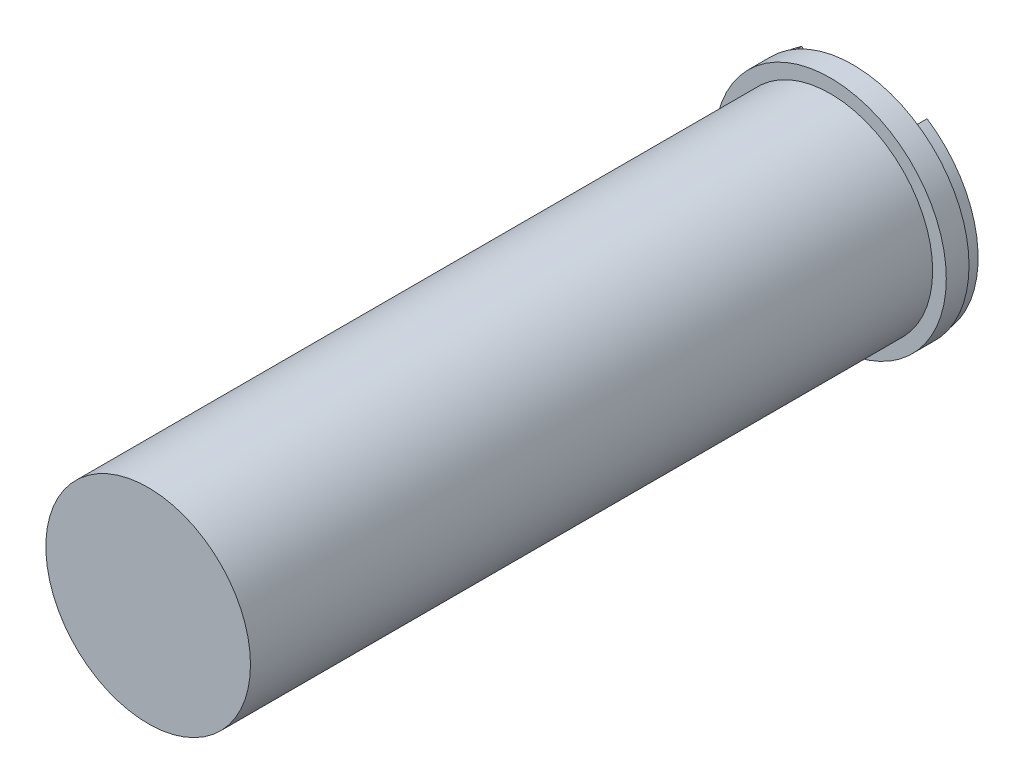
ISO-10303-21;
HEADER;
FILE_DESCRIPTION(('STEP AP214'),'2;1');
FILE_NAME('part.step','',(''),(''),'','','');
FILE_SCHEMA(('AUTOMOTIVE_DESIGN { 1 0 10303 214 1 1 1 1 }'));
ENDSEC;
DATA;
#1=APPLICATION_CONTEXT('core data for automotive mechanical design processes');
#2=APPLICATION_PROTOCOL_DEFINITION('international standard','automotive_design',2000,#1);
#3=PRODUCT_CONTEXT('',#1,'mechanical');
#4=PRODUCT('Part','Part','',(#3));
#5=PRODUCT_RELATED_PRODUCT_CATEGORY('part','',(#4));
#6=PRODUCT_DEFINITION_FORMATION('','',#4);
#7=PRODUCT_DEFINITION_CONTEXT('part definition',#1,'design');
#8=PRODUCT_DEFINITION('design','',#6,#7);
#9=PRODUCT_DEFINITION_SHAPE('','',#8);
#10=(LENGTH_UNIT() NAMED_UNIT(*) SI_UNIT(.MILLI.,.METRE.));
#11=(NAMED_UNIT(*) PLANE_ANGLE_UNIT() SI_UNIT($,.RADIAN.));
#12=(NAMED_UNIT(*) SI_UNIT($,.STERADIAN.) SOLID_ANGLE_UNIT());
#13=UNCERTAINTY_MEASURE_WITH_UNIT(LENGTH_MEASURE(1.E-05),#10,'distance_accuracy_value','');
#14=(GEOMETRIC_REPRESENTATION_CONTEXT(3) GLOBAL_UNCERTAINTY_ASSIGNED_CONTEXT((#13)) GLOBAL_UNIT_ASSIGNED_CONTEXT((#10,
#11,#12)) REPRESENTATION_CONTEXT('',''));
#15=CARTESIAN_POINT('',(0.,0.,0.));
#16=DIRECTION('',(0.,0.,1.));
#17=DIRECTION('',(1.,0.,0.));
#18=AXIS2_PLACEMENT_3D('',#15,#16,#17);
#19=CARTESIAN_POINT('',(0.,0.,-0.5));
#20=DIRECTION('',(0.,0.,-1.));
#21=DIRECTION('',(-1.,0.,0.));
#22=AXIS2_PLACEMENT_3D('',#19,#20,#21);
#23=PLANE('',#22);
#24=CARTESIAN_POINT('',(0.,0.,-0.5));
#25=DIRECTION('',(0.,0.,-1.));
#26=DIRECTION('',(-1.,0.,0.));
#27=AXIS2_PLACEMENT_3D('',#24,#25,#26);
#28=CIRCLE('',#27,4.);
#29=CARTESIAN_POINT('',(2.82842712474621,2.82842712474617,-0.5));
#30=VERTEX_POINT('',#29);
#31=CARTESIAN_POINT('',(3.96862696659689,0.5,-0.5));
#32=VERTEX_POINT('',#31);
#33=EDGE_CURVE('E144',#30,#32,#28,.T.);
#34=ORIENTED_EDGE('',*,*,#33,.F.);
#35=DIRECTION('',(0.707106781186551,0.707106781186543,0.));
#36=VECTOR('',#35,1.);
#37=CARTESIAN_POINT('',(2.82842712474621,2.82842712474617,-0.5));
#38=LINE('',#37,#36);
#39=CARTESIAN_POINT('',(0.500000000000014,0.5,-0.5));
#40=VERTEX_POINT('',#39);
#41=EDGE_CURVE('E142',#40,#30,#38,.T.);
#42=ORIENTED_EDGE('',*,*,#41,.F.);
#43=DIRECTION('',(-1.,0.,0.));
#44=VECTOR('',#43,1.);
#45=CARTESIAN_POINT('',(3.96862696659689,0.5,-0.5));
#46=LINE('',#45,#44);
#47=EDGE_CURVE('E148',#32,#40,#46,.T.);
#48=ORIENTED_EDGE('',*,*,#47,.F.);
#49=EDGE_LOOP('',(#34,#42,#48));
#50=FACE_BOUND('',#49,.T.);
#51=CARTESIAN_POINT('',(0.,0.,-0.5));
#52=DIRECTION('',(0.,0.,-1.));
#53=DIRECTION('',(-1.,0.,0.));
#54=AXIS2_PLACEMENT_3D('',#51,#52,#53);
#55=CIRCLE('',#54,5.);
#56=CARTESIAN_POINT('',(2.75699483395121,4.1712083963243,-0.5));
#57=VERTEX_POINT('',#56);
#58=CARTESIAN_POINT('',(-2.75699483395121,4.1712083963243,-0.5));
#59=VERTEX_POINT('',#58);
#60=EDGE_CURVE('E190',#57,#59,#55,.T.);
#61=ORIENTED_EDGE('',*,*,#60,.T.);
#62=DIRECTION('',(0.707106781186551,-0.707106781186544,0.));
#63=VECTOR('',#62,1.);
#64=CARTESIAN_POINT('',(-2.75699483395121,4.1712083963243,-0.5));
#65=LINE('',#64,#63);
#66=CARTESIAN_POINT('',(0.,1.41421356237312,-0.5));
#67=VERTEX_POINT('',#66);
#68=EDGE_CURVE('E193',#59,#67,#65,.T.);
#69=ORIENTED_EDGE('',*,*,#68,.T.);
#70=DIRECTION('',(0.707106781186552,0.707106781186543,0.));
#71=VECTOR('',#70,1.);
#72=CARTESIAN_POINT('',(2.75699483395121,4.1712083963243,-0.5));
#73=LINE('',#72,#71);
#74=EDGE_CURVE('E196',#67,#57,#73,.T.);
#75=ORIENTED_EDGE('',*,*,#74,.T.);
#76=EDGE_LOOP('',(#61,#69,#75));
#77=FACE_BOUND('',#76,.T.);
#78=DIRECTION('',(0.707106781186546,-0.707106781186549,0.));
#79=VECTOR('',#78,1.);
#80=CARTESIAN_POINT('',(-2.82842712474619,2.82842712474619,-0.5));
#81=LINE('',#80,#79);
#82=CARTESIAN_POINT('',(-2.82842712474619,2.82842712474619,-0.5));
#83=VERTEX_POINT('',#82);
#84=CARTESIAN_POINT('',(-0.499999999999973,0.499999999999967,-0.5));
#85=VERTEX_POINT('',#84);
#86=EDGE_CURVE('E168',#83,#85,#81,.T.);
#87=ORIENTED_EDGE('',*,*,#86,.F.);
#88=CARTESIAN_POINT('',(0.,0.,-0.5));
#89=DIRECTION('',(0.,0.,-1.));
#90=DIRECTION('',(-1.,0.,0.));
#91=AXIS2_PLACEMENT_3D('',#88,#89,#90);
#92=CIRCLE('',#91,4.);
#93=CARTESIAN_POINT('',(-3.96862696659689,0.5,-0.5));
#94=VERTEX_POINT('',#93);
#95=EDGE_CURVE('E166',#94,#83,#92,.T.);
#96=ORIENTED_EDGE('',*,*,#95,.F.);
#97=DIRECTION('',(-1.,0.,0.));
#98=VECTOR('',#97,1.);
#99=CARTESIAN_POINT('',(-0.499999999999973,0.499999999999967,-0.5));
#100=LINE('',#99,#98);
#101=EDGE_CURVE('E172',#85,#94,#100,.T.);
#102=ORIENTED_EDGE('',*,*,#101,.F.);
#103=EDGE_LOOP('',(#87,#96,#102));
#104=FACE_BOUND('',#103,.T.);
#105=DIRECTION('',(1.,0.,0.));
#106=VECTOR('',#105,1.);
#107=CARTESIAN_POINT('',(3.96862696659689,-0.5,-0.5));
#108=LINE('',#107,#106);
#109=CARTESIAN_POINT('',(-3.96862696659689,-0.5,-0.5));
#110=VERTEX_POINT('',#109);
#111=CARTESIAN_POINT('',(3.96862696659689,-0.5,-0.5));
#112=VERTEX_POINT('',#111);
#113=EDGE_CURVE('E125',#110,#112,#108,.T.);
#114=ORIENTED_EDGE('',*,*,#113,.F.);
#115=CARTESIAN_POINT('',(0.,0.,-0.5));
#116=DIRECTION('',(0.,0.,-1.));
#117=DIRECTION('',(-1.,0.,0.));
#118=AXIS2_PLACEMENT_3D('',#115,#116,#117);
#119=CIRCLE('',#118,4.);
#120=EDGE_CURVE('E131',#112,#110,#119,.T.);
#121=ORIENTED_EDGE('',*,*,#120,.F.);
#122=EDGE_LOOP('',(#114,#121));
#123=FACE_BOUND('',#122,.T.);
#124=ADVANCED_FACE('F43',(#50,#77,#104,#123),#23,.T.);
#125=CARTESIAN_POINT('',(0.,0.,0.));
#126=DIRECTION('',(0.,0.,-1.));
#127=DIRECTION('',(-1.,0.,0.));
#128=AXIS2_PLACEMENT_3D('',#125,#126,#127);
#129=PLANE('',#128);
#130=DIRECTION('',(0.707106781186551,0.707106781186543,0.));
#131=VECTOR('',#130,1.);
#132=CARTESIAN_POINT('',(2.82842712474621,2.82842712474617,0.));
#133=LINE('',#132,#131);
#134=CARTESIAN_POINT('',(0.500000000000014,0.5,0.));
#135=VERTEX_POINT('',#134);
#136=CARTESIAN_POINT('',(2.82842712474621,2.82842712474617,0.));
#137=VERTEX_POINT('',#136);
#138=EDGE_CURVE('E141',#135,#137,#133,.T.);
#139=ORIENTED_EDGE('',*,*,#138,.T.);
#140=CARTESIAN_POINT('',(0.,0.,0.));
#141=DIRECTION('',(0.,0.,-1.));
#142=DIRECTION('',(-1.,0.,0.));
#143=AXIS2_PLACEMENT_3D('',#140,#141,#142);
#144=CIRCLE('',#143,4.);
#145=CARTESIAN_POINT('',(3.96862696659689,0.5,0.));
#146=VERTEX_POINT('',#145);
#147=EDGE_CURVE('E153',#137,#146,#144,.T.);
#148=ORIENTED_EDGE('',*,*,#147,.T.);
#149=DIRECTION('',(-1.,0.,0.));
#150=VECTOR('',#149,1.);
#151=CARTESIAN_POINT('',(3.96862696659689,0.5,0.));
#152=LINE('',#151,#150);
#153=EDGE_CURVE('E145',#146,#135,#152,.T.);
#154=ORIENTED_EDGE('',*,*,#153,.T.);
#155=EDGE_LOOP('',(#139,#148,#154));
#156=FACE_BOUND('',#155,.T.);
#157=CARTESIAN_POINT('',(0.,0.,0.));
#158=DIRECTION('',(0.,0.,-1.));
#159=DIRECTION('',(-1.,0.,0.));
#160=AXIS2_PLACEMENT_3D('',#157,#158,#159);
#161=CIRCLE('',#160,5.);
#162=CARTESIAN_POINT('',(2.75699483395121,4.1712083963243,0.));
#163=VERTEX_POINT('',#162);
#164=CARTESIAN_POINT('',(-2.75699483395121,4.1712083963243,0.));
#165=VERTEX_POINT('',#164);
#166=EDGE_CURVE('E189',#163,#165,#161,.T.);
#167=ORIENTED_EDGE('',*,*,#166,.F.);
#168=DIRECTION('',(0.707106781186552,0.707106781186543,0.));
#169=VECTOR('',#168,1.);
#170=CARTESIAN_POINT('',(2.75699483395121,4.1712083963243,0.));
#171=LINE('',#170,#169);
#172=CARTESIAN_POINT('',(0.,1.41421356237312,0.));
#173=VERTEX_POINT('',#172);
#174=EDGE_CURVE('E194',#173,#163,#171,.T.);
#175=ORIENTED_EDGE('',*,*,#174,.F.);
#176=DIRECTION('',(0.707106781186551,-0.707106781186544,0.));
#177=VECTOR('',#176,1.);
#178=CARTESIAN_POINT('',(-2.75699483395121,4.1712083963243,0.));
#179=LINE('',#178,#177);
#180=EDGE_CURVE('E201',#165,#173,#179,.T.);
#181=ORIENTED_EDGE('',*,*,#180,.F.);
#182=EDGE_LOOP('',(#167,#175,#181));
#183=FACE_BOUND('',#182,.T.);
#184=CARTESIAN_POINT('',(0.,0.,0.));
#185=DIRECTION('',(0.,0.,-1.));
#186=DIRECTION('',(-1.,0.,0.));
#187=AXIS2_PLACEMENT_3D('',#184,#185,#186);
#188=CIRCLE('',#187,4.);
#189=CARTESIAN_POINT('',(-3.96862696659689,0.5,0.));
#190=VERTEX_POINT('',#189);
#191=CARTESIAN_POINT('',(-2.82842712474619,2.82842712474619,0.));
#192=VERTEX_POINT('',#191);
#193=EDGE_CURVE('E165',#190,#192,#188,.T.);
#194=ORIENTED_EDGE('',*,*,#193,.T.);
#195=DIRECTION('',(0.707106781186546,-0.707106781186549,0.));
#196=VECTOR('',#195,1.);
#197=CARTESIAN_POINT('',(-2.82842712474619,2.82842712474619,0.));
#198=LINE('',#197,#196);
#199=CARTESIAN_POINT('',(-0.499999999999973,0.499999999999967,0.));
#200=VERTEX_POINT('',#199);
#201=EDGE_CURVE('E177',#192,#200,#198,.T.);
#202=ORIENTED_EDGE('',*,*,#201,.T.);
#203=DIRECTION('',(-1.,0.,0.));
#204=VECTOR('',#203,1.);
#205=CARTESIAN_POINT('',(-0.499999999999973,0.499999999999967,0.));
#206=LINE('',#205,#204);
#207=EDGE_CURVE('E169',#200,#190,#206,.T.);
#208=ORIENTED_EDGE('',*,*,#207,.T.);
#209=EDGE_LOOP('',(#194,#202,#208));
#210=FACE_BOUND('',#209,.T.);
#211=CARTESIAN_POINT('',(0.,0.,0.));
#212=DIRECTION('',(0.,0.,-1.));
#213=DIRECTION('',(-1.,0.,0.));
#214=AXIS2_PLACEMENT_3D('',#211,#212,#213);
#215=CIRCLE('',#214,4.);
#216=CARTESIAN_POINT('',(3.96862696659689,-0.5,0.));
#217=VERTEX_POINT('',#216);
#218=CARTESIAN_POINT('',(-3.96862696659689,-0.5,0.));
#219=VERTEX_POINT('',#218);
#220=EDGE_CURVE('E65',#217,#219,#215,.T.);
#221=ORIENTED_EDGE('',*,*,#220,.T.);
#222=DIRECTION('',(1.,0.,0.));
#223=VECTOR('',#222,1.);
#224=CARTESIAN_POINT('',(3.96862696659689,-0.5,0.));
#225=LINE('',#224,#223);
#226=EDGE_CURVE('E135',#219,#217,#225,.T.);
#227=ORIENTED_EDGE('',*,*,#226,.T.);
#228=EDGE_LOOP('',(#221,#227));
#229=FACE_BOUND('',#228,.T.);
#230=ADVANCED_FACE('F215',(#156,#183,#210,#229),#129,.F.);
#231=CARTESIAN_POINT('',(0.,0.,-0.5));
#232=DIRECTION('',(0.,0.,1.));
#233=DIRECTION('',(1.,0.,0.));
#234=AXIS2_PLACEMENT_3D('',#231,#232,#233);
#235=CYLINDRICAL_SURFACE('',#234,5.);
#236=ORIENTED_EDGE('',*,*,#166,.T.);
#237=DIRECTION('',(0.,0.,1.));
#238=VECTOR('',#237,1.);
#239=CARTESIAN_POINT('',(-2.75699483395121,4.1712083963243,-0.5));
#240=LINE('',#239,#238);
#241=EDGE_CURVE('E12',#59,#165,#240,.T.);
#242=ORIENTED_EDGE('',*,*,#241,.F.);
#243=ORIENTED_EDGE('',*,*,#60,.F.);
#244=DIRECTION('',(0.,0.,1.));
#245=VECTOR('',#244,1.);
#246=CARTESIAN_POINT('',(2.75699483395121,4.1712083963243,-0.5));
#247=LINE('',#246,#245);
#248=EDGE_CURVE('E198',#57,#163,#247,.T.);
#249=ORIENTED_EDGE('',*,*,#248,.T.);
#250=EDGE_LOOP('',(#236,#242,#243,#249));
#251=FACE_BOUND('',#250,.T.);
#252=ADVANCED_FACE('F45',(#251),#235,.T.);
#253=CARTESIAN_POINT('',(-2.75699483395121,4.1712083963243,-0.5));
#254=DIRECTION('',(-0.707106781186544,-0.707106781186551,0.));
#255=DIRECTION('',(0.707106781186551,-0.707106781186544,0.));
#256=AXIS2_PLACEMENT_3D('',#253,#254,#255);
#257=PLANE('',#256);
#258=ORIENTED_EDGE('',*,*,#180,.T.);
#259=DIRECTION('',(0.,0.,1.));
#260=VECTOR('',#259,1.);
#261=CARTESIAN_POINT('',(0.,1.41421356237312,-0.5));
#262=LINE('',#261,#260);
#263=EDGE_CURVE('E51',#67,#173,#262,.T.);
#264=ORIENTED_EDGE('',*,*,#263,.F.);
#265=ORIENTED_EDGE('',*,*,#68,.F.);
#266=ORIENTED_EDGE('',*,*,#241,.T.);
#267=EDGE_LOOP('',(#258,#264,#265,#266));
#268=FACE_BOUND('',#267,.T.);
#269=ADVANCED_FACE('F222',(#268),#257,.F.);
#270=CARTESIAN_POINT('',(2.75699483395121,4.1712083963243,-0.5));
#271=DIRECTION('',(0.707106781186543,-0.707106781186552,0.));
#272=DIRECTION('',(0.707106781186552,0.707106781186543,0.));
#273=AXIS2_PLACEMENT_3D('',#270,#271,#272);
#274=PLANE('',#273);
#275=ORIENTED_EDGE('',*,*,#174,.T.);
#276=ORIENTED_EDGE('',*,*,#248,.F.);
#277=ORIENTED_EDGE('',*,*,#74,.F.);
#278=ORIENTED_EDGE('',*,*,#263,.T.);
#279=EDGE_LOOP('',(#275,#276,#277,#278));
#280=FACE_BOUND('',#279,.T.);
#281=ADVANCED_FACE('F210',(#280),#274,.F.);
#282=CARTESIAN_POINT('',(0.,0.,-0.5));
#283=DIRECTION('',(0.,0.,1.));
#284=DIRECTION('',(1.,0.,0.));
#285=AXIS2_PLACEMENT_3D('',#282,#283,#284);
#286=CYLINDRICAL_SURFACE('',#285,4.);
#287=ORIENTED_EDGE('',*,*,#193,.F.);
#288=DIRECTION('',(0.,0.,1.));
#289=VECTOR('',#288,1.);
#290=CARTESIAN_POINT('',(-3.96862696659689,0.5,-0.5));
#291=LINE('',#290,#289);
#292=EDGE_CURVE('E174',#94,#190,#291,.T.);
#293=ORIENTED_EDGE('',*,*,#292,.F.);
#294=ORIENTED_EDGE('',*,*,#95,.T.);
#295=DIRECTION('',(0.,0.,1.));
#296=VECTOR('',#295,1.);
#297=CARTESIAN_POINT('',(-2.82842712474619,2.82842712474619,-0.5));
#298=LINE('',#297,#296);
#299=EDGE_CURVE('E186',#83,#192,#298,.T.);
#300=ORIENTED_EDGE('',*,*,#299,.T.);
#301=EDGE_LOOP('',(#287,#293,#294,#300));
#302=FACE_BOUND('',#301,.T.);
#303=ADVANCED_FACE('F228',(#302),#286,.F.);
#304=CARTESIAN_POINT('',(-2.82842712474619,2.82842712474619,-0.5));
#305=DIRECTION('',(-0.707106781186549,-0.707106781186546,0.));
#306=DIRECTION('',(0.707106781186546,-0.707106781186549,0.));
#307=AXIS2_PLACEMENT_3D('',#304,#305,#306);
#308=PLANE('',#307);
#309=ORIENTED_EDGE('',*,*,#201,.F.);
#310=ORIENTED_EDGE('',*,*,#299,.F.);
#311=ORIENTED_EDGE('',*,*,#86,.T.);
#312=DIRECTION('',(0.,0.,1.));
#313=VECTOR('',#312,1.);
#314=CARTESIAN_POINT('',(-0.499999999999973,0.499999999999967,-0.5));
#315=LINE('',#314,#313);
#316=EDGE_CURVE('E184',#85,#200,#315,.T.);
#317=ORIENTED_EDGE('',*,*,#316,.T.);
#318=EDGE_LOOP('',(#309,#310,#311,#317));
#319=FACE_BOUND('',#318,.T.);
#320=ADVANCED_FACE('F242',(#319),#308,.T.);
#321=CARTESIAN_POINT('',(-0.499999999999973,0.499999999999967,-0.5));
#322=DIRECTION('',(0.,1.,0.));
#323=DIRECTION('',(-1.,0.,0.));
#324=AXIS2_PLACEMENT_3D('',#321,#322,#323);
#325=PLANE('',#324);
#326=ORIENTED_EDGE('',*,*,#207,.F.);
#327=ORIENTED_EDGE('',*,*,#316,.F.);
#328=ORIENTED_EDGE('',*,*,#101,.T.);
#329=ORIENTED_EDGE('',*,*,#292,.T.);
#330=EDGE_LOOP('',(#326,#327,#328,#329));
#331=FACE_BOUND('',#330,.T.);
#332=ADVANCED_FACE('F246',(#331),#325,.T.);
#333=CARTESIAN_POINT('',(2.82842712474621,2.82842712474617,-0.5));
#334=DIRECTION('',(0.707106781186543,-0.707106781186552,0.));
#335=DIRECTION('',(0.707106781186552,0.707106781186543,0.));
#336=AXIS2_PLACEMENT_3D('',#333,#334,#335);
#337=PLANE('',#336);
#338=ORIENTED_EDGE('',*,*,#138,.F.);
#339=DIRECTION('',(0.,0.,1.));
#340=VECTOR('',#339,1.);
#341=CARTESIAN_POINT('',(0.500000000000014,0.5,-0.5));
#342=LINE('',#341,#340);
#343=EDGE_CURVE('E150',#40,#135,#342,.T.);
#344=ORIENTED_EDGE('',*,*,#343,.F.);
#345=ORIENTED_EDGE('',*,*,#41,.T.);
#346=DIRECTION('',(0.,0.,1.));
#347=VECTOR('',#346,1.);
#348=CARTESIAN_POINT('',(2.82842712474621,2.82842712474617,-0.5));
#349=LINE('',#348,#347);
#350=EDGE_CURVE('E162',#30,#137,#349,.T.);
#351=ORIENTED_EDGE('',*,*,#350,.T.);
#352=EDGE_LOOP('',(#338,#344,#345,#351));
#353=FACE_BOUND('',#352,.T.);
#354=ADVANCED_FACE('F250',(#353),#337,.T.);
#355=CARTESIAN_POINT('',(0.,0.,-0.5));
#356=DIRECTION('',(0.,0.,1.));
#357=DIRECTION('',(1.,0.,0.));
#358=AXIS2_PLACEMENT_3D('',#355,#356,#357);
#359=CYLINDRICAL_SURFACE('',#358,4.);
#360=ORIENTED_EDGE('',*,*,#147,.F.);
#361=ORIENTED_EDGE('',*,*,#350,.F.);
#362=ORIENTED_EDGE('',*,*,#33,.T.);
#363=DIRECTION('',(0.,0.,1.));
#364=VECTOR('',#363,1.);
#365=CARTESIAN_POINT('',(3.96862696659689,0.5,-0.5));
#366=LINE('',#365,#364);
#367=EDGE_CURVE('E160',#32,#146,#366,.T.);
#368=ORIENTED_EDGE('',*,*,#367,.T.);
#369=EDGE_LOOP('',(#360,#361,#362,#368));
#370=FACE_BOUND('',#369,.T.);
#371=ADVANCED_FACE('F254',(#370),#359,.F.);
#372=CARTESIAN_POINT('',(3.96862696659689,0.5,-0.5));
#373=DIRECTION('',(0.,1.,0.));
#374=DIRECTION('',(-1.,0.,0.));
#375=AXIS2_PLACEMENT_3D('',#372,#373,#374);
#376=PLANE('',#375);
#377=ORIENTED_EDGE('',*,*,#153,.F.);
#378=ORIENTED_EDGE('',*,*,#367,.F.);
#379=ORIENTED_EDGE('',*,*,#47,.T.);
#380=ORIENTED_EDGE('',*,*,#343,.T.);
#381=EDGE_LOOP('',(#377,#378,#379,#380));
#382=FACE_BOUND('',#381,.T.);
#383=ADVANCED_FACE('F258',(#382),#376,.T.);
#384=CARTESIAN_POINT('',(0.,0.,-0.5));
#385=DIRECTION('',(0.,0.,1.));
#386=DIRECTION('',(1.,0.,0.));
#387=AXIS2_PLACEMENT_3D('',#384,#385,#386);
#388=CYLINDRICAL_SURFACE('',#387,4.);
#389=ORIENTED_EDGE('',*,*,#220,.F.);
#390=DIRECTION('',(0.,0.,1.));
#391=VECTOR('',#390,1.);
#392=CARTESIAN_POINT('',(3.96862696659689,-0.5,-0.5));
#393=LINE('',#392,#391);
#394=EDGE_CURVE('E127',#112,#217,#393,.T.);
#395=ORIENTED_EDGE('',*,*,#394,.F.);
#396=ORIENTED_EDGE('',*,*,#120,.T.);
#397=DIRECTION('',(0.,0.,1.));
#398=VECTOR('',#397,1.);
#399=CARTESIAN_POINT('',(-3.96862696659689,-0.5,-0.5));
#400=LINE('',#399,#398);
#401=EDGE_CURVE('E58',#110,#219,#400,.T.);
#402=ORIENTED_EDGE('',*,*,#401,.T.);
#403=EDGE_LOOP('',(#389,#395,#396,#402));
#404=FACE_BOUND('',#403,.T.);
#405=ADVANCED_FACE('F133',(#404),#388,.F.);
#406=CARTESIAN_POINT('',(3.96862696659689,-0.5,-0.5));
#407=DIRECTION('',(0.,-1.,0.));
#408=DIRECTION('',(0.,0.,-1.));
#409=AXIS2_PLACEMENT_3D('',#406,#407,#408);
#410=PLANE('',#409);
#411=ORIENTED_EDGE('',*,*,#226,.F.);
#412=ORIENTED_EDGE('',*,*,#401,.F.);
#413=ORIENTED_EDGE('',*,*,#113,.T.);
#414=ORIENTED_EDGE('',*,*,#394,.T.);
#415=EDGE_LOOP('',(#411,#412,#413,#414));
#416=FACE_BOUND('',#415,.T.);
#417=ADVANCED_FACE('F126',(#416),#410,.T.);
#418=CLOSED_SHELL('',(#124,#230,#252,#269,#281,#303,#320,#332,#354,#371,#383,#405,#417));
#419=MANIFOLD_SOLID_BREP('B2',#418);
#420=CARTESIAN_POINT('',(0.,0.,1.));
#421=DIRECTION('',(0.,0.,1.));
#422=DIRECTION('',(1.,0.,0.));
#423=AXIS2_PLACEMENT_3D('',#420,#421,#422);
#424=PLANE('',#423);
#425=CARTESIAN_POINT('',(0.,0.,1.));
#426=DIRECTION('',(0.,0.,1.));
#427=DIRECTION('',(1.,0.,0.));
#428=AXIS2_PLACEMENT_3D('',#425,#426,#427);
#429=CIRCLE('',#428,5.1);
#430=CARTESIAN_POINT('',(5.1,0.,1.));
#431=VERTEX_POINT('',#430);
#432=EDGE_CURVE('E42',#431,#431,#429,.T.);
#433=ORIENTED_EDGE('',*,*,#432,.T.);
#434=EDGE_LOOP('',(#433));
#435=FACE_BOUND('',#434,.T.);
#436=CARTESIAN_POINT('',(0.,0.,1.));
#437=DIRECTION('',(0.,0.,1.));
#438=DIRECTION('',(1.,0.,0.));
#439=AXIS2_PLACEMENT_3D('',#436,#437,#438);
#440=CIRCLE('',#439,4.5);
#441=CARTESIAN_POINT('',(4.5,0.,1.));
#442=VERTEX_POINT('',#441);
#443=EDGE_CURVE('E368',#442,#442,#440,.T.);
#444=ORIENTED_EDGE('',*,*,#443,.F.);
#445=EDGE_LOOP('',(#444));
#446=FACE_BOUND('',#445,.T.);
#447=ADVANCED_FACE('F355',(#435,#446),#424,.T.);
#448=CARTESIAN_POINT('',(0.,0.,1.));
#449=DIRECTION('',(0.,0.,-1.));
#450=DIRECTION('',(-1.,0.,0.));
#451=AXIS2_PLACEMENT_3D('',#448,#449,#450);
#452=CYLINDRICAL_SURFACE('',#451,5.1);
#453=ORIENTED_EDGE('',*,*,#432,.F.);
#454=EDGE_LOOP('',(#453));
#455=FACE_BOUND('',#454,.T.);
#456=CARTESIAN_POINT('',(0.,0.,0.));
#457=DIRECTION('',(0.,0.,1.));
#458=DIRECTION('',(1.,0.,0.));
#459=AXIS2_PLACEMENT_3D('',#456,#457,#458);
#460=CIRCLE('',#459,5.1);
#461=CARTESIAN_POINT('',(5.1,0.,0.));
#462=VERTEX_POINT('',#461);
#463=EDGE_CURVE('E359',#462,#462,#460,.T.);
#464=ORIENTED_EDGE('',*,*,#463,.T.);
#465=EDGE_LOOP('',(#464));
#466=FACE_BOUND('',#465,.T.);
#467=ADVANCED_FACE('F357',(#455,#466),#452,.T.);
#468=CARTESIAN_POINT('',(0.,0.,0.));
#469=DIRECTION('',(0.,0.,1.));
#470=DIRECTION('',(1.,0.,0.));
#471=AXIS2_PLACEMENT_3D('',#468,#469,#470);
#472=PLANE('',#471);
#473=ORIENTED_EDGE('',*,*,#463,.F.);
#474=EDGE_LOOP('',(#473));
#475=FACE_BOUND('',#474,.T.);
#476=ADVANCED_FACE('F379',(#475),#472,.F.);
#477=CARTESIAN_POINT('',(0.,0.,31.));
#478=DIRECTION('',(0.,0.,-1.));
#479=DIRECTION('',(-1.,0.,0.));
#480=AXIS2_PLACEMENT_3D('',#477,#478,#479);
#481=CYLINDRICAL_SURFACE('',#480,4.5);
#482=CARTESIAN_POINT('',(0.,0.,31.));
#483=DIRECTION('',(0.,0.,1.));
#484=DIRECTION('',(1.,0.,0.));
#485=AXIS2_PLACEMENT_3D('',#482,#483,#484);
#486=CIRCLE('',#485,4.5);
#487=CARTESIAN_POINT('',(4.5,0.,31.));
#488=VERTEX_POINT('',#487);
#489=EDGE_CURVE('E366',#488,#488,#486,.T.);
#490=ORIENTED_EDGE('',*,*,#489,.F.);
#491=EDGE_LOOP('',(#490));
#492=FACE_BOUND('',#491,.T.);
#493=ORIENTED_EDGE('',*,*,#443,.T.);
#494=EDGE_LOOP('',(#493));
#495=FACE_BOUND('',#494,.T.);
#496=ADVANCED_FACE('F376',(#492,#495),#481,.T.);
#497=CARTESIAN_POINT('',(0.,0.,31.));
#498=DIRECTION('',(0.,0.,1.));
#499=DIRECTION('',(1.,0.,0.));
#500=AXIS2_PLACEMENT_3D('',#497,#498,#499);
#501=PLANE('',#500);
#502=ORIENTED_EDGE('',*,*,#489,.T.);
#503=EDGE_LOOP('',(#502));
#504=FACE_BOUND('',#503,.T.);
#505=ADVANCED_FACE('F374',(#504),#501,.T.);
#506=CLOSED_SHELL('',(#447,#467,#476,#496,#505));
#507=MANIFOLD_SOLID_BREP('B6',#506);
#508=ADVANCED_BREP_SHAPE_REPRESENTATION('',(#18,#419,#507),#14);
#509=SHAPE_DEFINITION_REPRESENTATION(#9,#508);
ENDSEC;
END-ISO-10303-21;
